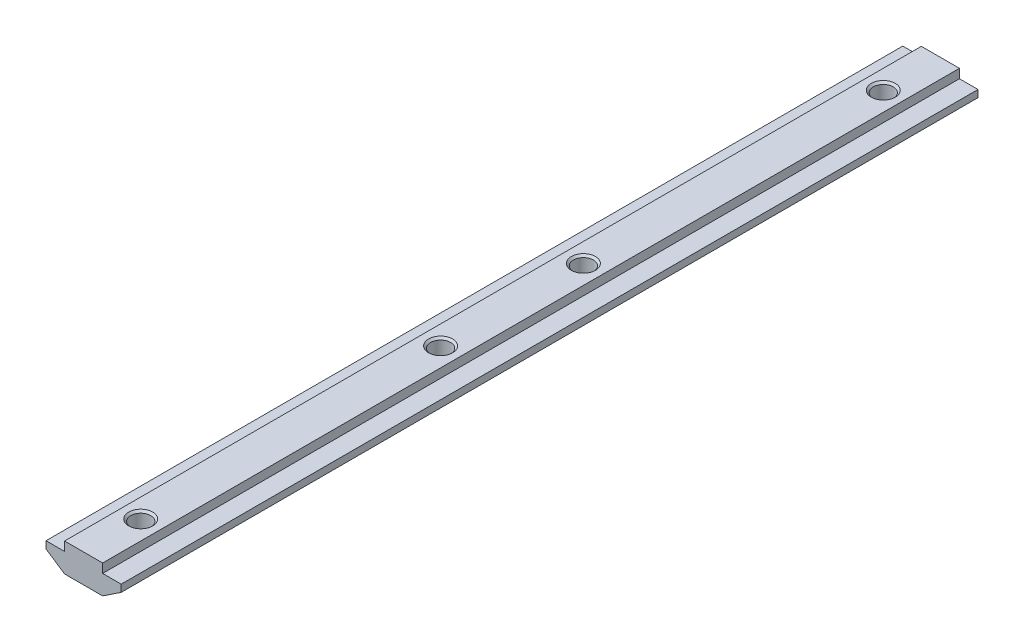
ISO-10303-21;
HEADER;
FILE_DESCRIPTION(('STEP AP214'),'2;1');
FILE_NAME('part.step','',(''),(''),'','','');
FILE_SCHEMA(('AUTOMOTIVE_DESIGN { 1 0 10303 214 1 1 1 1 }'));
ENDSEC;
DATA;
#1=APPLICATION_CONTEXT('core data for automotive mechanical design processes');
#2=APPLICATION_PROTOCOL_DEFINITION('international standard','automotive_design',2000,#1);
#3=PRODUCT_CONTEXT('',#1,'mechanical');
#4=PRODUCT('Part','Part','',(#3));
#5=PRODUCT_RELATED_PRODUCT_CATEGORY('part','',(#4));
#6=PRODUCT_DEFINITION_FORMATION('','',#4);
#7=PRODUCT_DEFINITION_CONTEXT('part definition',#1,'design');
#8=PRODUCT_DEFINITION('design','',#6,#7);
#9=PRODUCT_DEFINITION_SHAPE('','',#8);
#10=(LENGTH_UNIT() NAMED_UNIT(*) SI_UNIT(.MILLI.,.METRE.));
#11=(NAMED_UNIT(*) PLANE_ANGLE_UNIT() SI_UNIT($,.RADIAN.));
#12=(NAMED_UNIT(*) SI_UNIT($,.STERADIAN.) SOLID_ANGLE_UNIT());
#13=UNCERTAINTY_MEASURE_WITH_UNIT(LENGTH_MEASURE(1.E-05),#10,'distance_accuracy_value','');
#14=(GEOMETRIC_REPRESENTATION_CONTEXT(3) GLOBAL_UNCERTAINTY_ASSIGNED_CONTEXT((#13)) GLOBAL_UNIT_ASSIGNED_CONTEXT((#10,
#11,#12)) REPRESENTATION_CONTEXT('',''));
#15=CARTESIAN_POINT('',(0.,0.,0.));
#16=DIRECTION('',(0.,0.,1.));
#17=DIRECTION('',(1.,0.,0.));
#18=AXIS2_PLACEMENT_3D('',#15,#16,#17);
#19=CARTESIAN_POINT('',(-4.,0.,90.));
#20=DIRECTION('',(1.,0.,0.));
#21=DIRECTION('',(0.,0.,-1.));
#22=AXIS2_PLACEMENT_3D('',#19,#20,#21);
#23=PLANE('',#22);
#24=DIRECTION('',(0.,-1.,0.));
#25=VECTOR('',#24,1.);
#26=CARTESIAN_POINT('',(-4.,0.,-90.));
#27=LINE('',#26,#25);
#28=CARTESIAN_POINT('',(-4.,0.,-90.));
#29=VERTEX_POINT('',#28);
#30=CARTESIAN_POINT('',(-4.,-1.9,-90.));
#31=VERTEX_POINT('',#30);
#32=EDGE_CURVE('E145',#29,#31,#27,.T.);
#33=ORIENTED_EDGE('',*,*,#32,.T.);
#34=DIRECTION('',(0.,0.,-1.));
#35=VECTOR('',#34,1.);
#36=CARTESIAN_POINT('',(-4.,-1.9,90.));
#37=LINE('',#36,#35);
#38=CARTESIAN_POINT('',(-4.,-1.9,90.));
#39=VERTEX_POINT('',#38);
#40=EDGE_CURVE('E11',#39,#31,#37,.T.);
#41=ORIENTED_EDGE('',*,*,#40,.F.);
#42=DIRECTION('',(0.,-1.,0.));
#43=VECTOR('',#42,1.);
#44=CARTESIAN_POINT('',(-4.,0.,90.));
#45=LINE('',#44,#43);
#46=CARTESIAN_POINT('',(-4.,0.,90.));
#47=VERTEX_POINT('',#46);
#48=EDGE_CURVE('E164',#47,#39,#45,.T.);
#49=ORIENTED_EDGE('',*,*,#48,.F.);
#50=DIRECTION('',(0.,0.,-1.));
#51=VECTOR('',#50,1.);
#52=CARTESIAN_POINT('',(-4.,0.,90.));
#53=LINE('',#52,#51);
#54=EDGE_CURVE('E141',#47,#29,#53,.T.);
#55=ORIENTED_EDGE('',*,*,#54,.T.);
#56=EDGE_LOOP('',(#33,#41,#49,#55));
#57=FACE_BOUND('',#56,.T.);
#58=ADVANCED_FACE('F37',(#57),#23,.F.);
#59=CARTESIAN_POINT('',(-4.,-1.9,90.));
#60=DIRECTION('',(0.,-1.,0.));
#61=DIRECTION('',(1.,0.,0.));
#62=AXIS2_PLACEMENT_3D('',#59,#60,#61);
#63=PLANE('',#62);
#64=DIRECTION('',(-1.,0.,0.));
#65=VECTOR('',#64,1.);
#66=CARTESIAN_POINT('',(-4.,-1.9,-90.));
#67=LINE('',#66,#65);
#68=CARTESIAN_POINT('',(-7.9,-1.9,-90.));
#69=VERTEX_POINT('',#68);
#70=EDGE_CURVE('E148',#31,#69,#67,.T.);
#71=ORIENTED_EDGE('',*,*,#70,.T.);
#72=DIRECTION('',(0.,0.,-1.));
#73=VECTOR('',#72,1.);
#74=CARTESIAN_POINT('',(-7.9,-1.9,90.));
#75=LINE('',#74,#73);
#76=CARTESIAN_POINT('',(-7.9,-1.9,90.));
#77=VERTEX_POINT('',#76);
#78=EDGE_CURVE('E45',#77,#69,#75,.T.);
#79=ORIENTED_EDGE('',*,*,#78,.F.);
#80=DIRECTION('',(-1.,0.,0.));
#81=VECTOR('',#80,1.);
#82=CARTESIAN_POINT('',(-4.,-1.9,90.));
#83=LINE('',#82,#81);
#84=EDGE_CURVE('E102',#39,#77,#83,.T.);
#85=ORIENTED_EDGE('',*,*,#84,.F.);
#86=ORIENTED_EDGE('',*,*,#40,.T.);
#87=EDGE_LOOP('',(#71,#79,#85,#86));
#88=FACE_BOUND('',#87,.T.);
#89=ADVANCED_FACE('F308',(#88),#63,.F.);
#90=CARTESIAN_POINT('',(-7.9,-1.9,90.));
#91=DIRECTION('',(1.,0.,0.));
#92=DIRECTION('',(0.,0.,-1.));
#93=AXIS2_PLACEMENT_3D('',#90,#91,#92);
#94=PLANE('',#93);
#95=DIRECTION('',(0.,-1.,0.));
#96=VECTOR('',#95,1.);
#97=CARTESIAN_POINT('',(-7.9,-1.9,-90.));
#98=LINE('',#97,#96);
#99=CARTESIAN_POINT('',(-7.9,-3.4,-90.));
#100=VERTEX_POINT('',#99);
#101=EDGE_CURVE('E151',#69,#100,#98,.T.);
#102=ORIENTED_EDGE('',*,*,#101,.T.);
#103=DIRECTION('',(0.,0.,-1.));
#104=VECTOR('',#103,1.);
#105=CARTESIAN_POINT('',(-7.9,-3.4,90.));
#106=LINE('',#105,#104);
#107=CARTESIAN_POINT('',(-7.9,-3.4,90.));
#108=VERTEX_POINT('',#107);
#109=EDGE_CURVE('E177',#108,#100,#106,.T.);
#110=ORIENTED_EDGE('',*,*,#109,.F.);
#111=DIRECTION('',(0.,-1.,0.));
#112=VECTOR('',#111,1.);
#113=CARTESIAN_POINT('',(-7.9,-1.9,90.));
#114=LINE('',#113,#112);
#115=EDGE_CURVE('E185',#77,#108,#114,.T.);
#116=ORIENTED_EDGE('',*,*,#115,.F.);
#117=ORIENTED_EDGE('',*,*,#78,.T.);
#118=EDGE_LOOP('',(#102,#110,#116,#117));
#119=FACE_BOUND('',#118,.T.);
#120=ADVANCED_FACE('F183',(#119),#94,.F.);
#121=CARTESIAN_POINT('',(-7.9,-3.4,90.));
#122=DIRECTION('',(0.554700196225229,0.832050294337844,0.));
#123=DIRECTION('',(-0.832050294337844,0.554700196225229,0.));
#124=AXIS2_PLACEMENT_3D('',#121,#122,#123);
#125=PLANE('',#124);
#126=DIRECTION('',(0.832050294337844,-0.554700196225229,0.));
#127=VECTOR('',#126,1.);
#128=CARTESIAN_POINT('',(-7.9,-3.4,-90.));
#129=LINE('',#128,#127);
#130=CARTESIAN_POINT('',(-4.,-6.,-90.));
#131=VERTEX_POINT('',#130);
#132=EDGE_CURVE('E153',#100,#131,#129,.T.);
#133=ORIENTED_EDGE('',*,*,#132,.T.);
#134=DIRECTION('',(0.,0.,-1.));
#135=VECTOR('',#134,1.);
#136=CARTESIAN_POINT('',(-4.,-6.,90.));
#137=LINE('',#136,#135);
#138=CARTESIAN_POINT('',(-4.,-6.,90.));
#139=VERTEX_POINT('',#138);
#140=EDGE_CURVE('E174',#139,#131,#137,.T.);
#141=ORIENTED_EDGE('',*,*,#140,.F.);
#142=DIRECTION('',(0.832050294337844,-0.554700196225229,0.));
#143=VECTOR('',#142,1.);
#144=CARTESIAN_POINT('',(-7.9,-3.4,90.));
#145=LINE('',#144,#143);
#146=EDGE_CURVE('E203',#108,#139,#145,.T.);
#147=ORIENTED_EDGE('',*,*,#146,.F.);
#148=ORIENTED_EDGE('',*,*,#109,.T.);
#149=EDGE_LOOP('',(#133,#141,#147,#148));
#150=FACE_BOUND('',#149,.T.);
#151=ADVANCED_FACE('F194',(#150),#125,.F.);
#152=CARTESIAN_POINT('',(-4.,-6.,90.));
#153=DIRECTION('',(0.,1.,0.));
#154=DIRECTION('',(0.,0.,1.));
#155=AXIS2_PLACEMENT_3D('',#152,#153,#154);
#156=PLANE('',#155);
#157=CARTESIAN_POINT('',(0.,-6.,-78.));
#158=DIRECTION('',(0.,1.,0.));
#159=DIRECTION('',(0.,0.,1.));
#160=AXIS2_PLACEMENT_3D('',#157,#158,#159);
#161=CIRCLE('',#160,2.525);
#162=CARTESIAN_POINT('',(0.,-6.,-75.475));
#163=VERTEX_POINT('',#162);
#164=EDGE_CURVE('E255',#163,#163,#161,.T.);
#165=ORIENTED_EDGE('',*,*,#164,.T.);
#166=EDGE_LOOP('',(#165));
#167=FACE_BOUND('',#166,.T.);
#168=CARTESIAN_POINT('',(0.,-6.,-15.));
#169=DIRECTION('',(0.,1.,0.));
#170=DIRECTION('',(0.,0.,1.));
#171=AXIS2_PLACEMENT_3D('',#168,#169,#170);
#172=CIRCLE('',#171,2.525);
#173=CARTESIAN_POINT('',(0.,-6.,-12.475));
#174=VERTEX_POINT('',#173);
#175=EDGE_CURVE('E243',#174,#174,#172,.T.);
#176=ORIENTED_EDGE('',*,*,#175,.T.);
#177=EDGE_LOOP('',(#176));
#178=FACE_BOUND('',#177,.T.);
#179=CARTESIAN_POINT('',(0.,-6.,15.));
#180=DIRECTION('',(0.,1.,0.));
#181=DIRECTION('',(0.,0.,1.));
#182=AXIS2_PLACEMENT_3D('',#179,#180,#181);
#183=CIRCLE('',#182,2.525);
#184=CARTESIAN_POINT('',(0.,-6.,17.525));
#185=VERTEX_POINT('',#184);
#186=EDGE_CURVE('E231',#185,#185,#183,.T.);
#187=ORIENTED_EDGE('',*,*,#186,.T.);
#188=EDGE_LOOP('',(#187));
#189=FACE_BOUND('',#188,.T.);
#190=CARTESIAN_POINT('',(0.,-6.,78.));
#191=DIRECTION('',(0.,1.,0.));
#192=DIRECTION('',(0.,0.,1.));
#193=AXIS2_PLACEMENT_3D('',#190,#191,#192);
#194=CIRCLE('',#193,2.525);
#195=CARTESIAN_POINT('',(0.,-6.,80.525));
#196=VERTEX_POINT('',#195);
#197=EDGE_CURVE('E219',#196,#196,#194,.T.);
#198=ORIENTED_EDGE('',*,*,#197,.T.);
#199=EDGE_LOOP('',(#198));
#200=FACE_BOUND('',#199,.T.);
#201=DIRECTION('',(1.,0.,0.));
#202=VECTOR('',#201,1.);
#203=CARTESIAN_POINT('',(-4.,-6.,-90.));
#204=LINE('',#203,#202);
#205=CARTESIAN_POINT('',(4.,-6.,-90.));
#206=VERTEX_POINT('',#205);
#207=EDGE_CURVE('E155',#131,#206,#204,.T.);
#208=ORIENTED_EDGE('',*,*,#207,.T.);
#209=DIRECTION('',(0.,0.,-1.));
#210=VECTOR('',#209,1.);
#211=CARTESIAN_POINT('',(4.,-6.,90.));
#212=LINE('',#211,#210);
#213=CARTESIAN_POINT('',(4.,-6.,90.));
#214=VERTEX_POINT('',#213);
#215=EDGE_CURVE('E171',#214,#206,#212,.T.);
#216=ORIENTED_EDGE('',*,*,#215,.F.);
#217=DIRECTION('',(1.,0.,0.));
#218=VECTOR('',#217,1.);
#219=CARTESIAN_POINT('',(-4.,-6.,90.));
#220=LINE('',#219,#218);
#221=EDGE_CURVE('E200',#139,#214,#220,.T.);
#222=ORIENTED_EDGE('',*,*,#221,.F.);
#223=ORIENTED_EDGE('',*,*,#140,.T.);
#224=EDGE_LOOP('',(#208,#216,#222,#223));
#225=FACE_BOUND('',#224,.T.);
#226=ADVANCED_FACE('F198',(#167,#178,#189,#200,#225),#156,.F.);
#227=CARTESIAN_POINT('',(7.9,-3.4,90.));
#228=DIRECTION('',(-0.554700196225229,0.832050294337844,0.));
#229=DIRECTION('',(-0.832050294337844,-0.554700196225229,0.));
#230=AXIS2_PLACEMENT_3D('',#227,#228,#229);
#231=PLANE('',#230);
#232=DIRECTION('',(0.832050294337844,0.554700196225229,0.));
#233=VECTOR('',#232,1.);
#234=CARTESIAN_POINT('',(7.9,-3.4,-90.));
#235=LINE('',#234,#233);
#236=CARTESIAN_POINT('',(7.9,-3.4,-90.));
#237=VERTEX_POINT('',#236);
#238=EDGE_CURVE('E157',#206,#237,#235,.T.);
#239=ORIENTED_EDGE('',*,*,#238,.T.);
#240=DIRECTION('',(0.,0.,-1.));
#241=VECTOR('',#240,1.);
#242=CARTESIAN_POINT('',(7.9,-3.4,90.));
#243=LINE('',#242,#241);
#244=CARTESIAN_POINT('',(7.9,-3.4,90.));
#245=VERTEX_POINT('',#244);
#246=EDGE_CURVE('E168',#245,#237,#243,.T.);
#247=ORIENTED_EDGE('',*,*,#246,.F.);
#248=DIRECTION('',(0.832050294337844,0.554700196225229,0.));
#249=VECTOR('',#248,1.);
#250=CARTESIAN_POINT('',(7.9,-3.4,90.));
#251=LINE('',#250,#249);
#252=EDGE_CURVE('E202',#214,#245,#251,.T.);
#253=ORIENTED_EDGE('',*,*,#252,.F.);
#254=ORIENTED_EDGE('',*,*,#215,.T.);
#255=EDGE_LOOP('',(#239,#247,#253,#254));
#256=FACE_BOUND('',#255,.T.);
#257=ADVANCED_FACE('F320',(#256),#231,.F.);
#258=CARTESIAN_POINT('',(7.9,-1.9,90.));
#259=DIRECTION('',(-1.,0.,0.));
#260=DIRECTION('',(0.,0.,1.));
#261=AXIS2_PLACEMENT_3D('',#258,#259,#260);
#262=PLANE('',#261);
#263=DIRECTION('',(0.,1.,0.));
#264=VECTOR('',#263,1.);
#265=CARTESIAN_POINT('',(7.9,-1.9,-90.));
#266=LINE('',#265,#264);
#267=CARTESIAN_POINT('',(7.9,-1.9,-90.));
#268=VERTEX_POINT('',#267);
#269=EDGE_CURVE('E159',#237,#268,#266,.T.);
#270=ORIENTED_EDGE('',*,*,#269,.T.);
#271=DIRECTION('',(0.,0.,-1.));
#272=VECTOR('',#271,1.);
#273=CARTESIAN_POINT('',(7.9,-1.9,90.));
#274=LINE('',#273,#272);
#275=CARTESIAN_POINT('',(7.9,-1.9,90.));
#276=VERTEX_POINT('',#275);
#277=EDGE_CURVE('E136',#276,#268,#274,.T.);
#278=ORIENTED_EDGE('',*,*,#277,.F.);
#279=DIRECTION('',(0.,1.,0.));
#280=VECTOR('',#279,1.);
#281=CARTESIAN_POINT('',(7.9,-1.9,90.));
#282=LINE('',#281,#280);
#283=EDGE_CURVE('E127',#245,#276,#282,.T.);
#284=ORIENTED_EDGE('',*,*,#283,.F.);
#285=ORIENTED_EDGE('',*,*,#246,.T.);
#286=EDGE_LOOP('',(#270,#278,#284,#285));
#287=FACE_BOUND('',#286,.T.);
#288=ADVANCED_FACE('F317',(#287),#262,.F.);
#289=CARTESIAN_POINT('',(4.,-1.9,90.));
#290=DIRECTION('',(0.,-1.,0.));
#291=DIRECTION('',(1.,0.,0.));
#292=AXIS2_PLACEMENT_3D('',#289,#290,#291);
#293=PLANE('',#292);
#294=DIRECTION('',(-1.,0.,0.));
#295=VECTOR('',#294,1.);
#296=CARTESIAN_POINT('',(4.,-1.9,-90.));
#297=LINE('',#296,#295);
#298=CARTESIAN_POINT('',(4.,-1.9,-90.));
#299=VERTEX_POINT('',#298);
#300=EDGE_CURVE('E135',#268,#299,#297,.T.);
#301=ORIENTED_EDGE('',*,*,#300,.T.);
#302=DIRECTION('',(0.,0.,-1.));
#303=VECTOR('',#302,1.);
#304=CARTESIAN_POINT('',(4.,-1.9,90.));
#305=LINE('',#304,#303);
#306=CARTESIAN_POINT('',(4.,-1.9,90.));
#307=VERTEX_POINT('',#306);
#308=EDGE_CURVE('E132',#307,#299,#305,.T.);
#309=ORIENTED_EDGE('',*,*,#308,.F.);
#310=DIRECTION('',(-1.,0.,0.));
#311=VECTOR('',#310,1.);
#312=CARTESIAN_POINT('',(4.,-1.9,90.));
#313=LINE('',#312,#311);
#314=EDGE_CURVE('E121',#276,#307,#313,.T.);
#315=ORIENTED_EDGE('',*,*,#314,.F.);
#316=ORIENTED_EDGE('',*,*,#277,.T.);
#317=EDGE_LOOP('',(#301,#309,#315,#316));
#318=FACE_BOUND('',#317,.T.);
#319=ADVANCED_FACE('F133',(#318),#293,.F.);
#320=CARTESIAN_POINT('',(4.,0.,90.));
#321=DIRECTION('',(-1.,0.,0.));
#322=DIRECTION('',(0.,0.,1.));
#323=AXIS2_PLACEMENT_3D('',#320,#321,#322);
#324=PLANE('',#323);
#325=DIRECTION('',(0.,1.,0.));
#326=VECTOR('',#325,1.);
#327=CARTESIAN_POINT('',(4.,0.,-90.));
#328=LINE('',#327,#326);
#329=CARTESIAN_POINT('',(4.,0.,-90.));
#330=VERTEX_POINT('',#329);
#331=EDGE_CURVE('E88',#299,#330,#328,.T.);
#332=ORIENTED_EDGE('',*,*,#331,.T.);
#333=DIRECTION('',(0.,0.,-1.));
#334=VECTOR('',#333,1.);
#335=CARTESIAN_POINT('',(4.,0.,90.));
#336=LINE('',#335,#334);
#337=CARTESIAN_POINT('',(4.,0.,90.));
#338=VERTEX_POINT('',#337);
#339=EDGE_CURVE('E137',#338,#330,#336,.T.);
#340=ORIENTED_EDGE('',*,*,#339,.F.);
#341=DIRECTION('',(0.,1.,0.));
#342=VECTOR('',#341,1.);
#343=CARTESIAN_POINT('',(4.,0.,90.));
#344=LINE('',#343,#342);
#345=EDGE_CURVE('E125',#307,#338,#344,.T.);
#346=ORIENTED_EDGE('',*,*,#345,.F.);
#347=ORIENTED_EDGE('',*,*,#308,.T.);
#348=EDGE_LOOP('',(#332,#340,#346,#347));
#349=FACE_BOUND('',#348,.T.);
#350=ADVANCED_FACE('F139',(#349),#324,.F.);
#351=CARTESIAN_POINT('',(4.,0.,90.));
#352=DIRECTION('',(0.,-1.,0.));
#353=DIRECTION('',(0.,0.,-1.));
#354=AXIS2_PLACEMENT_3D('',#351,#352,#353);
#355=PLANE('',#354);
#356=CARTESIAN_POINT('',(0.,0.,-78.));
#357=DIRECTION('',(0.,1.,0.));
#358=DIRECTION('',(0.,0.,1.));
#359=AXIS2_PLACEMENT_3D('',#356,#357,#358);
#360=CIRCLE('',#359,2.525);
#361=CARTESIAN_POINT('',(0.,0.,-75.475));
#362=VERTEX_POINT('',#361);
#363=EDGE_CURVE('E252',#362,#362,#360,.T.);
#364=ORIENTED_EDGE('',*,*,#363,.F.);
#365=EDGE_LOOP('',(#364));
#366=FACE_BOUND('',#365,.T.);
#367=CARTESIAN_POINT('',(0.,0.,-15.));
#368=DIRECTION('',(0.,1.,0.));
#369=DIRECTION('',(0.,0.,1.));
#370=AXIS2_PLACEMENT_3D('',#367,#368,#369);
#371=CIRCLE('',#370,2.525);
#372=CARTESIAN_POINT('',(0.,0.,-12.475));
#373=VERTEX_POINT('',#372);
#374=EDGE_CURVE('E240',#373,#373,#371,.T.);
#375=ORIENTED_EDGE('',*,*,#374,.F.);
#376=EDGE_LOOP('',(#375));
#377=FACE_BOUND('',#376,.T.);
#378=CARTESIAN_POINT('',(0.,0.,15.));
#379=DIRECTION('',(0.,1.,0.));
#380=DIRECTION('',(0.,0.,1.));
#381=AXIS2_PLACEMENT_3D('',#378,#379,#380);
#382=CIRCLE('',#381,2.525);
#383=CARTESIAN_POINT('',(0.,0.,17.525));
#384=VERTEX_POINT('',#383);
#385=EDGE_CURVE('E228',#384,#384,#382,.T.);
#386=ORIENTED_EDGE('',*,*,#385,.F.);
#387=EDGE_LOOP('',(#386));
#388=FACE_BOUND('',#387,.T.);
#389=CARTESIAN_POINT('',(0.,0.,78.));
#390=DIRECTION('',(0.,1.,0.));
#391=DIRECTION('',(0.,0.,1.));
#392=AXIS2_PLACEMENT_3D('',#389,#390,#391);
#393=CIRCLE('',#392,2.525);
#394=CARTESIAN_POINT('',(0.,0.,80.525));
#395=VERTEX_POINT('',#394);
#396=EDGE_CURVE('E216',#395,#395,#393,.T.);
#397=ORIENTED_EDGE('',*,*,#396,.F.);
#398=EDGE_LOOP('',(#397));
#399=FACE_BOUND('',#398,.T.);
#400=DIRECTION('',(-1.,0.,0.));
#401=VECTOR('',#400,1.);
#402=CARTESIAN_POINT('',(4.,0.,-90.));
#403=LINE('',#402,#401);
#404=EDGE_CURVE('E94',#330,#29,#403,.T.);
#405=ORIENTED_EDGE('',*,*,#404,.T.);
#406=ORIENTED_EDGE('',*,*,#54,.F.);
#407=DIRECTION('',(-1.,0.,0.));
#408=VECTOR('',#407,1.);
#409=CARTESIAN_POINT('',(4.,0.,90.));
#410=LINE('',#409,#408);
#411=EDGE_CURVE('E53',#338,#47,#410,.T.);
#412=ORIENTED_EDGE('',*,*,#411,.F.);
#413=ORIENTED_EDGE('',*,*,#339,.T.);
#414=EDGE_LOOP('',(#405,#406,#412,#413));
#415=FACE_BOUND('',#414,.T.);
#416=ADVANCED_FACE('F280',(#366,#377,#388,#399,#415),#355,.F.);
#417=CARTESIAN_POINT('',(0.,0.,90.));
#418=DIRECTION('',(0.,0.,-1.));
#419=DIRECTION('',(-1.,0.,0.));
#420=AXIS2_PLACEMENT_3D('',#417,#418,#419);
#421=PLANE('',#420);
#422=ORIENTED_EDGE('',*,*,#48,.T.);
#423=ORIENTED_EDGE('',*,*,#84,.T.);
#424=ORIENTED_EDGE('',*,*,#115,.T.);
#425=ORIENTED_EDGE('',*,*,#146,.T.);
#426=ORIENTED_EDGE('',*,*,#221,.T.);
#427=ORIENTED_EDGE('',*,*,#252,.T.);
#428=ORIENTED_EDGE('',*,*,#283,.T.);
#429=ORIENTED_EDGE('',*,*,#314,.T.);
#430=ORIENTED_EDGE('',*,*,#345,.T.);
#431=ORIENTED_EDGE('',*,*,#411,.T.);
#432=EDGE_LOOP('',(#422,#423,#424,#425,#426,#427,#428,#429,#430,#431));
#433=FACE_BOUND('',#432,.T.);
#434=ADVANCED_FACE('F123',(#433),#421,.F.);
#435=CARTESIAN_POINT('',(0.,0.,-90.));
#436=DIRECTION('',(0.,0.,-1.));
#437=DIRECTION('',(-1.,0.,0.));
#438=AXIS2_PLACEMENT_3D('',#435,#436,#437);
#439=PLANE('',#438);
#440=ORIENTED_EDGE('',*,*,#32,.F.);
#441=ORIENTED_EDGE('',*,*,#404,.F.);
#442=ORIENTED_EDGE('',*,*,#331,.F.);
#443=ORIENTED_EDGE('',*,*,#300,.F.);
#444=ORIENTED_EDGE('',*,*,#269,.F.);
#445=ORIENTED_EDGE('',*,*,#238,.F.);
#446=ORIENTED_EDGE('',*,*,#207,.F.);
#447=ORIENTED_EDGE('',*,*,#132,.F.);
#448=ORIENTED_EDGE('',*,*,#101,.F.);
#449=ORIENTED_EDGE('',*,*,#70,.F.);
#450=EDGE_LOOP('',(#440,#441,#442,#443,#444,#445,#446,#447,#448,#449));
#451=FACE_BOUND('',#450,.T.);
#452=ADVANCED_FACE('F189',(#451),#439,.T.);
#453=CARTESIAN_POINT('',(0.,-5.575,78.));
#454=DIRECTION('',(0.,-1.,0.));
#455=DIRECTION('',(0.,0.,-1.));
#456=AXIS2_PLACEMENT_3D('',#453,#454,#455);
#457=CONICAL_SURFACE('',#456,2.1,0.785398163397451);
#458=ORIENTED_EDGE('',*,*,#197,.F.);
#459=EDGE_LOOP('',(#458));
#460=FACE_BOUND('',#459,.T.);
#461=CARTESIAN_POINT('',(0.,-5.575,78.));
#462=DIRECTION('',(0.,1.,0.));
#463=DIRECTION('',(0.,0.,1.));
#464=AXIS2_PLACEMENT_3D('',#461,#462,#463);
#465=CIRCLE('',#464,2.1);
#466=CARTESIAN_POINT('',(0.,-5.575,80.1));
#467=VERTEX_POINT('',#466);
#468=EDGE_CURVE('E149',#467,#467,#465,.T.);
#469=ORIENTED_EDGE('',*,*,#468,.T.);
#470=EDGE_LOOP('',(#469));
#471=FACE_BOUND('',#470,.T.);
#472=ADVANCED_FACE('F303',(#460,#471),#457,.F.);
#473=CARTESIAN_POINT('',(0.,0.,78.));
#474=DIRECTION('',(0.,1.,0.));
#475=DIRECTION('',(0.,0.,1.));
#476=AXIS2_PLACEMENT_3D('',#473,#474,#475);
#477=CYLINDRICAL_SURFACE('',#476,2.09999999999999);
#478=ORIENTED_EDGE('',*,*,#468,.F.);
#479=EDGE_LOOP('',(#478));
#480=FACE_BOUND('',#479,.T.);
#481=CARTESIAN_POINT('',(0.,-0.424999999999995,78.));
#482=DIRECTION('',(0.,1.,0.));
#483=DIRECTION('',(0.,0.,1.));
#484=AXIS2_PLACEMENT_3D('',#481,#482,#483);
#485=CIRCLE('',#484,2.09999999999999);
#486=CARTESIAN_POINT('',(0.,-0.424999999999995,80.1));
#487=VERTEX_POINT('',#486);
#488=EDGE_CURVE('E213',#487,#487,#485,.T.);
#489=ORIENTED_EDGE('',*,*,#488,.T.);
#490=EDGE_LOOP('',(#489));
#491=FACE_BOUND('',#490,.T.);
#492=ADVANCED_FACE('F293',(#480,#491),#477,.F.);
#493=CARTESIAN_POINT('',(0.,0.,78.));
#494=DIRECTION('',(0.,1.,0.));
#495=DIRECTION('',(0.,0.,1.));
#496=AXIS2_PLACEMENT_3D('',#493,#494,#495);
#497=CONICAL_SURFACE('',#496,2.525,0.785398163397467);
#498=ORIENTED_EDGE('',*,*,#488,.F.);
#499=EDGE_LOOP('',(#498));
#500=FACE_BOUND('',#499,.T.);
#501=ORIENTED_EDGE('',*,*,#396,.T.);
#502=EDGE_LOOP('',(#501));
#503=FACE_BOUND('',#502,.T.);
#504=ADVANCED_FACE('F290',(#500,#503),#497,.F.);
#505=CARTESIAN_POINT('',(0.,-5.575,15.));
#506=DIRECTION('',(0.,-1.,0.));
#507=DIRECTION('',(0.,0.,-1.));
#508=AXIS2_PLACEMENT_3D('',#505,#506,#507);
#509=CONICAL_SURFACE('',#508,2.1,0.785398163397451);
#510=ORIENTED_EDGE('',*,*,#186,.F.);
#511=EDGE_LOOP('',(#510));
#512=FACE_BOUND('',#511,.T.);
#513=CARTESIAN_POINT('',(0.,-5.575,15.));
#514=DIRECTION('',(0.,1.,0.));
#515=DIRECTION('',(0.,0.,1.));
#516=AXIS2_PLACEMENT_3D('',#513,#514,#515);
#517=CIRCLE('',#516,2.1);
#518=CARTESIAN_POINT('',(0.,-5.575,17.1));
#519=VERTEX_POINT('',#518);
#520=EDGE_CURVE('E222',#519,#519,#517,.T.);
#521=ORIENTED_EDGE('',*,*,#520,.T.);
#522=EDGE_LOOP('',(#521));
#523=FACE_BOUND('',#522,.T.);
#524=ADVANCED_FACE('F292',(#512,#523),#509,.F.);
#525=CARTESIAN_POINT('',(0.,0.,15.));
#526=DIRECTION('',(0.,1.,0.));
#527=DIRECTION('',(0.,0.,1.));
#528=AXIS2_PLACEMENT_3D('',#525,#526,#527);
#529=CYLINDRICAL_SURFACE('',#528,2.09999999999999);
#530=ORIENTED_EDGE('',*,*,#520,.F.);
#531=EDGE_LOOP('',(#530));
#532=FACE_BOUND('',#531,.T.);
#533=CARTESIAN_POINT('',(0.,-0.424999999999995,15.));
#534=DIRECTION('',(0.,1.,0.));
#535=DIRECTION('',(0.,0.,1.));
#536=AXIS2_PLACEMENT_3D('',#533,#534,#535);
#537=CIRCLE('',#536,2.09999999999999);
#538=CARTESIAN_POINT('',(0.,-0.424999999999995,17.1));
#539=VERTEX_POINT('',#538);
#540=EDGE_CURVE('E225',#539,#539,#537,.T.);
#541=ORIENTED_EDGE('',*,*,#540,.T.);
#542=EDGE_LOOP('',(#541));
#543=FACE_BOUND('',#542,.T.);
#544=ADVANCED_FACE('F300',(#532,#543),#529,.F.);
#545=CARTESIAN_POINT('',(0.,0.,15.));
#546=DIRECTION('',(0.,1.,0.));
#547=DIRECTION('',(0.,0.,1.));
#548=AXIS2_PLACEMENT_3D('',#545,#546,#547);
#549=CONICAL_SURFACE('',#548,2.525,0.785398163397467);
#550=ORIENTED_EDGE('',*,*,#540,.F.);
#551=EDGE_LOOP('',(#550));
#552=FACE_BOUND('',#551,.T.);
#553=ORIENTED_EDGE('',*,*,#385,.T.);
#554=EDGE_LOOP('',(#553));
#555=FACE_BOUND('',#554,.T.);
#556=ADVANCED_FACE('F400',(#552,#555),#549,.F.);
#557=CARTESIAN_POINT('',(0.,-5.575,-15.));
#558=DIRECTION('',(0.,-1.,0.));
#559=DIRECTION('',(0.,0.,-1.));
#560=AXIS2_PLACEMENT_3D('',#557,#558,#559);
#561=CONICAL_SURFACE('',#560,2.1,0.785398163397451);
#562=ORIENTED_EDGE('',*,*,#175,.F.);
#563=EDGE_LOOP('',(#562));
#564=FACE_BOUND('',#563,.T.);
#565=CARTESIAN_POINT('',(0.,-5.575,-15.));
#566=DIRECTION('',(0.,1.,0.));
#567=DIRECTION('',(0.,0.,1.));
#568=AXIS2_PLACEMENT_3D('',#565,#566,#567);
#569=CIRCLE('',#568,2.1);
#570=CARTESIAN_POINT('',(0.,-5.575,-12.9));
#571=VERTEX_POINT('',#570);
#572=EDGE_CURVE('E234',#571,#571,#569,.T.);
#573=ORIENTED_EDGE('',*,*,#572,.T.);
#574=EDGE_LOOP('',(#573));
#575=FACE_BOUND('',#574,.T.);
#576=ADVANCED_FACE('F410',(#564,#575),#561,.F.);
#577=CARTESIAN_POINT('',(0.,0.,-15.));
#578=DIRECTION('',(0.,1.,0.));
#579=DIRECTION('',(0.,0.,1.));
#580=AXIS2_PLACEMENT_3D('',#577,#578,#579);
#581=CYLINDRICAL_SURFACE('',#580,2.09999999999999);
#582=ORIENTED_EDGE('',*,*,#572,.F.);
#583=EDGE_LOOP('',(#582));
#584=FACE_BOUND('',#583,.T.);
#585=CARTESIAN_POINT('',(0.,-0.424999999999995,-15.));
#586=DIRECTION('',(0.,1.,0.));
#587=DIRECTION('',(0.,0.,1.));
#588=AXIS2_PLACEMENT_3D('',#585,#586,#587);
#589=CIRCLE('',#588,2.09999999999999);
#590=CARTESIAN_POINT('',(0.,-0.424999999999995,-12.9));
#591=VERTEX_POINT('',#590);
#592=EDGE_CURVE('E237',#591,#591,#589,.T.);
#593=ORIENTED_EDGE('',*,*,#592,.T.);
#594=EDGE_LOOP('',(#593));
#595=FACE_BOUND('',#594,.T.);
#596=ADVANCED_FACE('F420',(#584,#595),#581,.F.);
#597=CARTESIAN_POINT('',(0.,0.,-15.));
#598=DIRECTION('',(0.,1.,0.));
#599=DIRECTION('',(0.,0.,1.));
#600=AXIS2_PLACEMENT_3D('',#597,#598,#599);
#601=CONICAL_SURFACE('',#600,2.525,0.785398163397467);
#602=ORIENTED_EDGE('',*,*,#592,.F.);
#603=EDGE_LOOP('',(#602));
#604=FACE_BOUND('',#603,.T.);
#605=ORIENTED_EDGE('',*,*,#374,.T.);
#606=EDGE_LOOP('',(#605));
#607=FACE_BOUND('',#606,.T.);
#608=ADVANCED_FACE('F265',(#604,#607),#601,.F.);
#609=CARTESIAN_POINT('',(0.,-5.575,-78.));
#610=DIRECTION('',(0.,-1.,0.));
#611=DIRECTION('',(0.,0.,-1.));
#612=AXIS2_PLACEMENT_3D('',#609,#610,#611);
#613=CONICAL_SURFACE('',#612,2.1,0.785398163397451);
#614=ORIENTED_EDGE('',*,*,#164,.F.);
#615=EDGE_LOOP('',(#614));
#616=FACE_BOUND('',#615,.T.);
#617=CARTESIAN_POINT('',(0.,-5.575,-78.));
#618=DIRECTION('',(0.,1.,0.));
#619=DIRECTION('',(0.,0.,1.));
#620=AXIS2_PLACEMENT_3D('',#617,#618,#619);
#621=CIRCLE('',#620,2.1);
#622=CARTESIAN_POINT('',(0.,-5.575,-75.9));
#623=VERTEX_POINT('',#622);
#624=EDGE_CURVE('E246',#623,#623,#621,.T.);
#625=ORIENTED_EDGE('',*,*,#624,.T.);
#626=EDGE_LOOP('',(#625));
#627=FACE_BOUND('',#626,.T.);
#628=ADVANCED_FACE('F261',(#616,#627),#613,.F.);
#629=CARTESIAN_POINT('',(0.,0.,-78.));
#630=DIRECTION('',(0.,1.,0.));
#631=DIRECTION('',(0.,0.,1.));
#632=AXIS2_PLACEMENT_3D('',#629,#630,#631);
#633=CYLINDRICAL_SURFACE('',#632,2.09999999999999);
#634=ORIENTED_EDGE('',*,*,#624,.F.);
#635=EDGE_LOOP('',(#634));
#636=FACE_BOUND('',#635,.T.);
#637=CARTESIAN_POINT('',(0.,-0.424999999999995,-78.));
#638=DIRECTION('',(0.,1.,0.));
#639=DIRECTION('',(0.,0.,1.));
#640=AXIS2_PLACEMENT_3D('',#637,#638,#639);
#641=CIRCLE('',#640,2.09999999999999);
#642=CARTESIAN_POINT('',(0.,-0.424999999999995,-75.9));
#643=VERTEX_POINT('',#642);
#644=EDGE_CURVE('E249',#643,#643,#641,.T.);
#645=ORIENTED_EDGE('',*,*,#644,.T.);
#646=EDGE_LOOP('',(#645));
#647=FACE_BOUND('',#646,.T.);
#648=ADVANCED_FACE('F264',(#636,#647),#633,.F.);
#649=CARTESIAN_POINT('',(0.,0.,-78.));
#650=DIRECTION('',(0.,1.,0.));
#651=DIRECTION('',(0.,0.,1.));
#652=AXIS2_PLACEMENT_3D('',#649,#650,#651);
#653=CONICAL_SURFACE('',#652,2.525,0.785398163397467);
#654=ORIENTED_EDGE('',*,*,#644,.F.);
#655=EDGE_LOOP('',(#654));
#656=FACE_BOUND('',#655,.T.);
#657=ORIENTED_EDGE('',*,*,#363,.T.);
#658=EDGE_LOOP('',(#657));
#659=FACE_BOUND('',#658,.T.);
#660=ADVANCED_FACE('F271',(#656,#659),#653,.F.);
#661=CLOSED_SHELL('',(#58,#89,#120,#151,#226,#257,#288,#319,#350,#416,#434,#452,#472,#492,#504,
#524,#544,#556,#576,#596,#608,#628,#648,#660));
#662=MANIFOLD_SOLID_BREP('B2',#661);
#663=ADVANCED_BREP_SHAPE_REPRESENTATION('',(#18,#662),#14);
#664=SHAPE_DEFINITION_REPRESENTATION(#9,#663);
ENDSEC;
END-ISO-10303-21;
